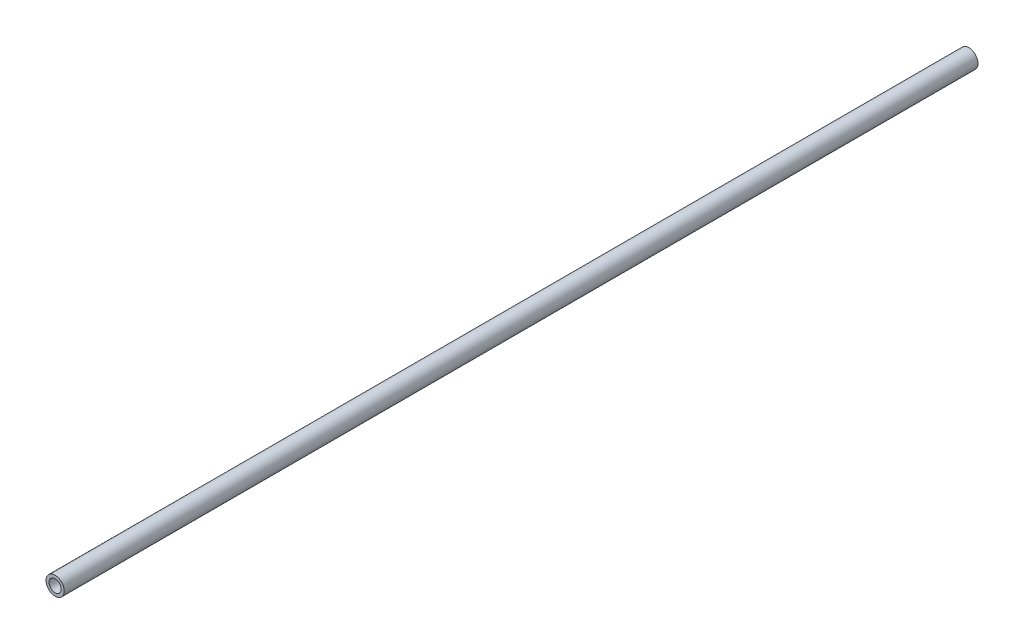
ISO-10303-21;
HEADER;
FILE_DESCRIPTION(('STEP AP214'),'2;1');
FILE_NAME('part.step','',(''),(''),'','','');
FILE_SCHEMA(('AUTOMOTIVE_DESIGN { 1 0 10303 214 1 1 1 1 }'));
ENDSEC;
DATA;
#1=APPLICATION_CONTEXT('core data for automotive mechanical design processes');
#2=APPLICATION_PROTOCOL_DEFINITION('international standard','automotive_design',2000,#1);
#3=PRODUCT_CONTEXT('',#1,'mechanical');
#4=PRODUCT('Part','Part','',(#3));
#5=PRODUCT_RELATED_PRODUCT_CATEGORY('part','',(#4));
#6=PRODUCT_DEFINITION_FORMATION('','',#4);
#7=PRODUCT_DEFINITION_CONTEXT('part definition',#1,'design');
#8=PRODUCT_DEFINITION('design','',#6,#7);
#9=PRODUCT_DEFINITION_SHAPE('','',#8);
#10=(LENGTH_UNIT() NAMED_UNIT(*) SI_UNIT(.MILLI.,.METRE.));
#11=(NAMED_UNIT(*) PLANE_ANGLE_UNIT() SI_UNIT($,.RADIAN.));
#12=(NAMED_UNIT(*) SI_UNIT($,.STERADIAN.) SOLID_ANGLE_UNIT());
#13=UNCERTAINTY_MEASURE_WITH_UNIT(LENGTH_MEASURE(1.E-05),#10,'distance_accuracy_value','');
#14=(GEOMETRIC_REPRESENTATION_CONTEXT(3) GLOBAL_UNCERTAINTY_ASSIGNED_CONTEXT((#13)) GLOBAL_UNIT_ASSIGNED_CONTEXT((#10,
#11,#12)) REPRESENTATION_CONTEXT('',''));
#15=CARTESIAN_POINT('',(0.,0.,0.));
#16=DIRECTION('',(0.,0.,1.));
#17=DIRECTION('',(1.,0.,0.));
#18=AXIS2_PLACEMENT_3D('',#15,#16,#17);
#19=CARTESIAN_POINT('',(0.,0.,300.));
#20=DIRECTION('',(0.,0.,1.));
#21=DIRECTION('',(1.,0.,0.));
#22=AXIS2_PLACEMENT_3D('',#19,#20,#21);
#23=PLANE('',#22);
#24=CARTESIAN_POINT('',(0.,0.,300.));
#25=DIRECTION('',(0.,0.,1.));
#26=DIRECTION('',(1.,0.,0.));
#27=AXIS2_PLACEMENT_3D('',#24,#25,#26);
#28=CIRCLE('',#27,3.);
#29=CARTESIAN_POINT('',(3.,0.,300.));
#30=VERTEX_POINT('',#29);
#31=EDGE_CURVE('E10',#30,#30,#28,.T.);
#32=ORIENTED_EDGE('',*,*,#31,.T.);
#33=EDGE_LOOP('',(#32));
#34=FACE_BOUND('',#33,.T.);
#35=CARTESIAN_POINT('',(0.,0.,300.));
#36=DIRECTION('',(0.,0.,1.));
#37=DIRECTION('',(1.,0.,0.));
#38=AXIS2_PLACEMENT_3D('',#35,#36,#37);
#39=CIRCLE('',#38,2.);
#40=CARTESIAN_POINT('',(2.,0.,300.));
#41=VERTEX_POINT('',#40);
#42=EDGE_CURVE('E50',#41,#41,#39,.T.);
#43=ORIENTED_EDGE('',*,*,#42,.F.);
#44=EDGE_LOOP('',(#43));
#45=FACE_BOUND('',#44,.T.);
#46=ADVANCED_FACE('F37',(#34,#45),#23,.T.);
#47=CARTESIAN_POINT('',(0.,0.,0.));
#48=DIRECTION('',(0.,0.,1.));
#49=DIRECTION('',(1.,0.,0.));
#50=AXIS2_PLACEMENT_3D('',#47,#48,#49);
#51=PLANE('',#50);
#52=CARTESIAN_POINT('',(0.,0.,0.));
#53=DIRECTION('',(0.,0.,1.));
#54=DIRECTION('',(1.,0.,0.));
#55=AXIS2_PLACEMENT_3D('',#52,#53,#54);
#56=CIRCLE('',#55,3.);
#57=CARTESIAN_POINT('',(3.,0.,0.));
#58=VERTEX_POINT('',#57);
#59=EDGE_CURVE('E41',#58,#58,#56,.T.);
#60=ORIENTED_EDGE('',*,*,#59,.F.);
#61=EDGE_LOOP('',(#60));
#62=FACE_BOUND('',#61,.T.);
#63=CARTESIAN_POINT('',(0.,0.,0.));
#64=DIRECTION('',(0.,0.,1.));
#65=DIRECTION('',(1.,0.,0.));
#66=AXIS2_PLACEMENT_3D('',#63,#64,#65);
#67=CIRCLE('',#66,2.);
#68=CARTESIAN_POINT('',(2.,0.,0.));
#69=VERTEX_POINT('',#68);
#70=EDGE_CURVE('E52',#69,#69,#67,.T.);
#71=ORIENTED_EDGE('',*,*,#70,.T.);
#72=EDGE_LOOP('',(#71));
#73=FACE_BOUND('',#72,.T.);
#74=ADVANCED_FACE('F64',(#62,#73),#51,.F.);
#75=CARTESIAN_POINT('',(0.,0.,300.));
#76=DIRECTION('',(0.,0.,-1.));
#77=DIRECTION('',(-1.,0.,0.));
#78=AXIS2_PLACEMENT_3D('',#75,#76,#77);
#79=CYLINDRICAL_SURFACE('',#78,3.);
#80=ORIENTED_EDGE('',*,*,#31,.F.);
#81=EDGE_LOOP('',(#80));
#82=FACE_BOUND('',#81,.T.);
#83=ORIENTED_EDGE('',*,*,#59,.T.);
#84=EDGE_LOOP('',(#83));
#85=FACE_BOUND('',#84,.T.);
#86=ADVANCED_FACE('F39',(#82,#85),#79,.T.);
#87=CARTESIAN_POINT('',(0.,0.,300.));
#88=DIRECTION('',(0.,0.,-1.));
#89=DIRECTION('',(-1.,0.,0.));
#90=AXIS2_PLACEMENT_3D('',#87,#88,#89);
#91=CYLINDRICAL_SURFACE('',#90,2.);
#92=ORIENTED_EDGE('',*,*,#42,.T.);
#93=EDGE_LOOP('',(#92));
#94=FACE_BOUND('',#93,.T.);
#95=ORIENTED_EDGE('',*,*,#70,.F.);
#96=EDGE_LOOP('',(#95));
#97=FACE_BOUND('',#96,.T.);
#98=ADVANCED_FACE('F60',(#94,#97),#91,.F.);
#99=CLOSED_SHELL('',(#46,#74,#86,#98));
#100=MANIFOLD_SOLID_BREP('B2',#99);
#101=ADVANCED_BREP_SHAPE_REPRESENTATION('',(#18,#100),#14);
#102=SHAPE_DEFINITION_REPRESENTATION(#9,#101);
ENDSEC;
END-ISO-10303-21;
